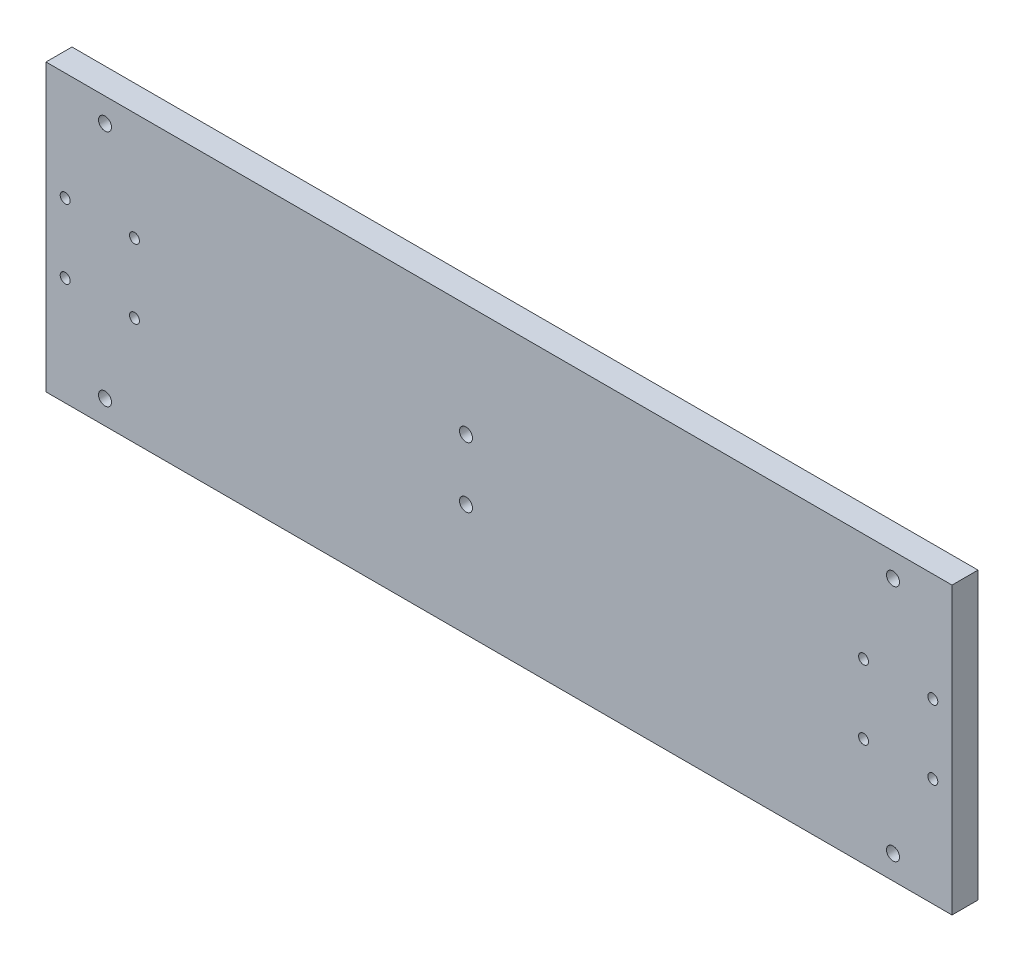
ISO-10303-21;
HEADER;
FILE_DESCRIPTION(('STEP AP214'),'2;1');
FILE_NAME('part.step','',(''),(''),'','','');
FILE_SCHEMA(('AUTOMOTIVE_DESIGN { 1 0 10303 214 1 1 1 1 }'));
ENDSEC;
DATA;
#1=APPLICATION_CONTEXT('core data for automotive mechanical design processes');
#2=APPLICATION_PROTOCOL_DEFINITION('international standard','automotive_design',2000,#1);
#3=PRODUCT_CONTEXT('',#1,'mechanical');
#4=PRODUCT('Part','Part','',(#3));
#5=PRODUCT_RELATED_PRODUCT_CATEGORY('part','',(#4));
#6=PRODUCT_DEFINITION_FORMATION('','',#4);
#7=PRODUCT_DEFINITION_CONTEXT('part definition',#1,'design');
#8=PRODUCT_DEFINITION('design','',#6,#7);
#9=PRODUCT_DEFINITION_SHAPE('','',#8);
#10=(LENGTH_UNIT() NAMED_UNIT(*) SI_UNIT(.MILLI.,.METRE.));
#11=(NAMED_UNIT(*) PLANE_ANGLE_UNIT() SI_UNIT($,.RADIAN.));
#12=(NAMED_UNIT(*) SI_UNIT($,.STERADIAN.) SOLID_ANGLE_UNIT());
#13=UNCERTAINTY_MEASURE_WITH_UNIT(LENGTH_MEASURE(1.E-05),#10,'distance_accuracy_value','');
#14=(GEOMETRIC_REPRESENTATION_CONTEXT(3) GLOBAL_UNCERTAINTY_ASSIGNED_CONTEXT((#13)) GLOBAL_UNIT_ASSIGNED_CONTEXT((#10,
#11,#12)) REPRESENTATION_CONTEXT('',''));
#15=CARTESIAN_POINT('',(0.,0.,0.));
#16=DIRECTION('',(0.,0.,1.));
#17=DIRECTION('',(1.,0.,0.));
#18=AXIS2_PLACEMENT_3D('',#15,#16,#17);
#19=CARTESIAN_POINT('',(-104.63,33.,6.));
#20=DIRECTION('',(1.,0.,0.));
#21=DIRECTION('',(0.,1.,0.));
#22=AXIS2_PLACEMENT_3D('',#19,#20,#21);
#23=PLANE('',#22);
#24=DIRECTION('',(0.,-1.,0.));
#25=VECTOR('',#24,1.);
#26=CARTESIAN_POINT('',(-104.63,33.,0.));
#27=LINE('',#26,#25);
#28=CARTESIAN_POINT('',(-104.63,33.,0.));
#29=VERTEX_POINT('',#28);
#30=CARTESIAN_POINT('',(-104.63,-33.,0.));
#31=VERTEX_POINT('',#30);
#32=EDGE_CURVE('E96',#29,#31,#27,.T.);
#33=ORIENTED_EDGE('',*,*,#32,.T.);
#34=DIRECTION('',(0.,0.,-1.));
#35=VECTOR('',#34,1.);
#36=CARTESIAN_POINT('',(-104.63,-33.,6.));
#37=LINE('',#36,#35);
#38=CARTESIAN_POINT('',(-104.63,-33.,6.));
#39=VERTEX_POINT('',#38);
#40=EDGE_CURVE('E11',#39,#31,#37,.T.);
#41=ORIENTED_EDGE('',*,*,#40,.F.);
#42=DIRECTION('',(0.,-1.,0.));
#43=VECTOR('',#42,1.);
#44=CARTESIAN_POINT('',(-104.63,33.,6.));
#45=LINE('',#44,#43);
#46=CARTESIAN_POINT('',(-104.63,33.,6.));
#47=VERTEX_POINT('',#46);
#48=EDGE_CURVE('E84',#47,#39,#45,.T.);
#49=ORIENTED_EDGE('',*,*,#48,.F.);
#50=DIRECTION('',(0.,0.,-1.));
#51=VECTOR('',#50,1.);
#52=CARTESIAN_POINT('',(-104.63,33.,6.));
#53=LINE('',#52,#51);
#54=EDGE_CURVE('E92',#47,#29,#53,.T.);
#55=ORIENTED_EDGE('',*,*,#54,.T.);
#56=EDGE_LOOP('',(#33,#41,#49,#55));
#57=FACE_BOUND('',#56,.T.);
#58=ADVANCED_FACE('F33',(#57),#23,.F.);
#59=CARTESIAN_POINT('',(-104.63,-33.,6.));
#60=DIRECTION('',(0.,1.,0.));
#61=DIRECTION('',(0.,0.,1.));
#62=AXIS2_PLACEMENT_3D('',#59,#60,#61);
#63=PLANE('',#62);
#64=DIRECTION('',(1.,0.,0.));
#65=VECTOR('',#64,1.);
#66=CARTESIAN_POINT('',(-104.63,-33.,0.));
#67=LINE('',#66,#65);
#68=CARTESIAN_POINT('',(104.63,-33.,0.));
#69=VERTEX_POINT('',#68);
#70=EDGE_CURVE('E88',#31,#69,#67,.T.);
#71=ORIENTED_EDGE('',*,*,#70,.T.);
#72=DIRECTION('',(0.,0.,-1.));
#73=VECTOR('',#72,1.);
#74=CARTESIAN_POINT('',(104.63,-33.,6.));
#75=LINE('',#74,#73);
#76=CARTESIAN_POINT('',(104.63,-33.,6.));
#77=VERTEX_POINT('',#76);
#78=EDGE_CURVE('E41',#77,#69,#75,.T.);
#79=ORIENTED_EDGE('',*,*,#78,.F.);
#80=DIRECTION('',(1.,0.,0.));
#81=VECTOR('',#80,1.);
#82=CARTESIAN_POINT('',(-104.63,-33.,6.));
#83=LINE('',#82,#81);
#84=EDGE_CURVE('E79',#39,#77,#83,.T.);
#85=ORIENTED_EDGE('',*,*,#84,.F.);
#86=ORIENTED_EDGE('',*,*,#40,.T.);
#87=EDGE_LOOP('',(#71,#79,#85,#86));
#88=FACE_BOUND('',#87,.T.);
#89=ADVANCED_FACE('F87',(#88),#63,.F.);
#90=CARTESIAN_POINT('',(104.63,33.,6.));
#91=DIRECTION('',(-1.,0.,0.));
#92=DIRECTION('',(0.,-1.,0.));
#93=AXIS2_PLACEMENT_3D('',#90,#91,#92);
#94=PLANE('',#93);
#95=DIRECTION('',(0.,1.,0.));
#96=VECTOR('',#95,1.);
#97=CARTESIAN_POINT('',(104.63,33.,0.));
#98=LINE('',#97,#96);
#99=CARTESIAN_POINT('',(104.63,33.,0.));
#100=VERTEX_POINT('',#99);
#101=EDGE_CURVE('E66',#69,#100,#98,.T.);
#102=ORIENTED_EDGE('',*,*,#101,.T.);
#103=DIRECTION('',(0.,0.,-1.));
#104=VECTOR('',#103,1.);
#105=CARTESIAN_POINT('',(104.63,33.,6.));
#106=LINE('',#105,#104);
#107=CARTESIAN_POINT('',(104.63,33.,6.));
#108=VERTEX_POINT('',#107);
#109=EDGE_CURVE('E89',#108,#100,#106,.T.);
#110=ORIENTED_EDGE('',*,*,#109,.F.);
#111=DIRECTION('',(0.,1.,0.));
#112=VECTOR('',#111,1.);
#113=CARTESIAN_POINT('',(104.63,33.,6.));
#114=LINE('',#113,#112);
#115=EDGE_CURVE('E82',#77,#108,#114,.T.);
#116=ORIENTED_EDGE('',*,*,#115,.F.);
#117=ORIENTED_EDGE('',*,*,#78,.T.);
#118=EDGE_LOOP('',(#102,#110,#116,#117));
#119=FACE_BOUND('',#118,.T.);
#120=ADVANCED_FACE('F90',(#119),#94,.F.);
#121=CARTESIAN_POINT('',(-104.63,33.,6.));
#122=DIRECTION('',(0.,-1.,0.));
#123=DIRECTION('',(0.,0.,-1.));
#124=AXIS2_PLACEMENT_3D('',#121,#122,#123);
#125=PLANE('',#124);
#126=DIRECTION('',(-1.,0.,0.));
#127=VECTOR('',#126,1.);
#128=CARTESIAN_POINT('',(-104.63,33.,0.));
#129=LINE('',#128,#127);
#130=EDGE_CURVE('E72',#100,#29,#129,.T.);
#131=ORIENTED_EDGE('',*,*,#130,.T.);
#132=ORIENTED_EDGE('',*,*,#54,.F.);
#133=DIRECTION('',(-1.,0.,0.));
#134=VECTOR('',#133,1.);
#135=CARTESIAN_POINT('',(-104.63,33.,6.));
#136=LINE('',#135,#134);
#137=EDGE_CURVE('E49',#108,#47,#136,.T.);
#138=ORIENTED_EDGE('',*,*,#137,.F.);
#139=ORIENTED_EDGE('',*,*,#109,.T.);
#140=EDGE_LOOP('',(#131,#132,#138,#139));
#141=FACE_BOUND('',#140,.T.);
#142=ADVANCED_FACE('F104',(#141),#125,.F.);
#143=CARTESIAN_POINT('',(0.,0.,6.));
#144=DIRECTION('',(0.,0.,1.));
#145=DIRECTION('',(1.,0.,0.));
#146=AXIS2_PLACEMENT_3D('',#143,#144,#145);
#147=PLANE('',#146);
#148=CARTESIAN_POINT('',(-91.,27.5,6.));
#149=DIRECTION('',(0.,0.,1.));
#150=DIRECTION('',(-1.,0.,0.));
#151=AXIS2_PLACEMENT_3D('',#148,#149,#150);
#152=CIRCLE('',#151,1.5);
#153=CARTESIAN_POINT('',(-92.5,27.5,6.));
#154=VERTEX_POINT('',#153);
#155=EDGE_CURVE('E188',#154,#154,#152,.T.);
#156=ORIENTED_EDGE('',*,*,#155,.F.);
#157=EDGE_LOOP('',(#156));
#158=FACE_BOUND('',#157,.T.);
#159=CARTESIAN_POINT('',(-91.,-27.5,6.));
#160=DIRECTION('',(0.,0.,1.));
#161=DIRECTION('',(-1.,0.,0.));
#162=AXIS2_PLACEMENT_3D('',#159,#160,#161);
#163=CIRCLE('',#162,1.5);
#164=CARTESIAN_POINT('',(-92.5,-27.5,6.));
#165=VERTEX_POINT('',#164);
#166=EDGE_CURVE('E182',#165,#165,#163,.T.);
#167=ORIENTED_EDGE('',*,*,#166,.F.);
#168=EDGE_LOOP('',(#167));
#169=FACE_BOUND('',#168,.T.);
#170=CARTESIAN_POINT('',(91.,-27.5,6.));
#171=DIRECTION('',(0.,0.,1.));
#172=DIRECTION('',(1.,0.,0.));
#173=AXIS2_PLACEMENT_3D('',#170,#171,#172);
#174=CIRCLE('',#173,1.5);
#175=CARTESIAN_POINT('',(92.5,-27.5,6.));
#176=VERTEX_POINT('',#175);
#177=EDGE_CURVE('E176',#176,#176,#174,.T.);
#178=ORIENTED_EDGE('',*,*,#177,.F.);
#179=EDGE_LOOP('',(#178));
#180=FACE_BOUND('',#179,.T.);
#181=CARTESIAN_POINT('',(91.,27.5,6.));
#182=DIRECTION('',(0.,0.,1.));
#183=DIRECTION('',(1.,0.,0.));
#184=AXIS2_PLACEMENT_3D('',#181,#182,#183);
#185=CIRCLE('',#184,1.5);
#186=CARTESIAN_POINT('',(92.5,27.5,6.));
#187=VERTEX_POINT('',#186);
#188=EDGE_CURVE('E170',#187,#187,#185,.T.);
#189=ORIENTED_EDGE('',*,*,#188,.F.);
#190=EDGE_LOOP('',(#189));
#191=FACE_BOUND('',#190,.T.);
#192=CARTESIAN_POINT('',(-7.62499999999999,-7.,6.));
#193=DIRECTION('',(0.,0.,1.));
#194=DIRECTION('',(1.,0.,0.));
#195=AXIS2_PLACEMENT_3D('',#192,#193,#194);
#196=CIRCLE('',#195,1.5);
#197=CARTESIAN_POINT('',(-6.12499999999999,-7.,6.));
#198=VERTEX_POINT('',#197);
#199=EDGE_CURVE('E164',#198,#198,#196,.T.);
#200=ORIENTED_EDGE('',*,*,#199,.F.);
#201=EDGE_LOOP('',(#200));
#202=FACE_BOUND('',#201,.T.);
#203=CARTESIAN_POINT('',(-7.62499999999999,7.,6.));
#204=DIRECTION('',(0.,0.,1.));
#205=DIRECTION('',(1.,0.,0.));
#206=AXIS2_PLACEMENT_3D('',#203,#204,#205);
#207=CIRCLE('',#206,1.5);
#208=CARTESIAN_POINT('',(-6.12499999999999,7.,6.));
#209=VERTEX_POINT('',#208);
#210=EDGE_CURVE('E158',#209,#209,#207,.T.);
#211=ORIENTED_EDGE('',*,*,#210,.F.);
#212=EDGE_LOOP('',(#211));
#213=FACE_BOUND('',#212,.T.);
#214=CARTESIAN_POINT('',(100.2,8.00000000000002,6.));
#215=DIRECTION('',(0.,0.,1.));
#216=DIRECTION('',(-1.,0.,0.));
#217=AXIS2_PLACEMENT_3D('',#214,#215,#216);
#218=CIRCLE('',#217,1.15);
#219=CARTESIAN_POINT('',(99.05,8.00000000000002,6.));
#220=VERTEX_POINT('',#219);
#221=EDGE_CURVE('E152',#220,#220,#218,.T.);
#222=ORIENTED_EDGE('',*,*,#221,.F.);
#223=EDGE_LOOP('',(#222));
#224=FACE_BOUND('',#223,.T.);
#225=CARTESIAN_POINT('',(84.2,8.00000000000003,6.));
#226=DIRECTION('',(0.,0.,1.));
#227=DIRECTION('',(-1.,0.,0.));
#228=AXIS2_PLACEMENT_3D('',#225,#226,#227);
#229=CIRCLE('',#228,1.15);
#230=CARTESIAN_POINT('',(83.05,8.00000000000003,6.));
#231=VERTEX_POINT('',#230);
#232=EDGE_CURVE('E146',#231,#231,#229,.T.);
#233=ORIENTED_EDGE('',*,*,#232,.F.);
#234=EDGE_LOOP('',(#233));
#235=FACE_BOUND('',#234,.T.);
#236=CARTESIAN_POINT('',(84.2,-7.99999999999997,6.));
#237=DIRECTION('',(0.,0.,1.));
#238=DIRECTION('',(-1.,0.,0.));
#239=AXIS2_PLACEMENT_3D('',#236,#237,#238);
#240=CIRCLE('',#239,1.15);
#241=CARTESIAN_POINT('',(83.05,-7.99999999999997,6.));
#242=VERTEX_POINT('',#241);
#243=EDGE_CURVE('E140',#242,#242,#240,.T.);
#244=ORIENTED_EDGE('',*,*,#243,.F.);
#245=EDGE_LOOP('',(#244));
#246=FACE_BOUND('',#245,.T.);
#247=CARTESIAN_POINT('',(100.2,-7.99999999999998,6.));
#248=DIRECTION('',(0.,0.,1.));
#249=DIRECTION('',(-1.,0.,0.));
#250=AXIS2_PLACEMENT_3D('',#247,#248,#249);
#251=CIRCLE('',#250,1.15);
#252=CARTESIAN_POINT('',(99.05,-7.99999999999998,6.));
#253=VERTEX_POINT('',#252);
#254=EDGE_CURVE('E134',#253,#253,#251,.T.);
#255=ORIENTED_EDGE('',*,*,#254,.F.);
#256=EDGE_LOOP('',(#255));
#257=FACE_BOUND('',#256,.T.);
#258=CARTESIAN_POINT('',(-100.2,-8.,6.));
#259=DIRECTION('',(0.,0.,1.));
#260=DIRECTION('',(1.,0.,0.));
#261=AXIS2_PLACEMENT_3D('',#258,#259,#260);
#262=CIRCLE('',#261,1.15);
#263=CARTESIAN_POINT('',(-99.05,-8.,6.));
#264=VERTEX_POINT('',#263);
#265=EDGE_CURVE('E128',#264,#264,#262,.T.);
#266=ORIENTED_EDGE('',*,*,#265,.F.);
#267=EDGE_LOOP('',(#266));
#268=FACE_BOUND('',#267,.T.);
#269=CARTESIAN_POINT('',(-84.2,-7.99999999999999,6.));
#270=DIRECTION('',(0.,0.,1.));
#271=DIRECTION('',(1.,0.,0.));
#272=AXIS2_PLACEMENT_3D('',#269,#270,#271);
#273=CIRCLE('',#272,1.15);
#274=CARTESIAN_POINT('',(-83.05,-7.99999999999999,6.));
#275=VERTEX_POINT('',#274);
#276=EDGE_CURVE('E122',#275,#275,#273,.T.);
#277=ORIENTED_EDGE('',*,*,#276,.F.);
#278=EDGE_LOOP('',(#277));
#279=FACE_BOUND('',#278,.T.);
#280=CARTESIAN_POINT('',(-84.2,8.00000000000001,6.));
#281=DIRECTION('',(0.,0.,1.));
#282=DIRECTION('',(1.,0.,0.));
#283=AXIS2_PLACEMENT_3D('',#280,#281,#282);
#284=CIRCLE('',#283,1.15);
#285=CARTESIAN_POINT('',(-83.05,8.00000000000001,6.));
#286=VERTEX_POINT('',#285);
#287=EDGE_CURVE('E116',#286,#286,#284,.T.);
#288=ORIENTED_EDGE('',*,*,#287,.F.);
#289=EDGE_LOOP('',(#288));
#290=FACE_BOUND('',#289,.T.);
#291=CARTESIAN_POINT('',(-100.2,8.,6.));
#292=DIRECTION('',(0.,0.,1.));
#293=DIRECTION('',(1.,0.,0.));
#294=AXIS2_PLACEMENT_3D('',#291,#292,#293);
#295=CIRCLE('',#294,1.15);
#296=CARTESIAN_POINT('',(-99.05,8.,6.));
#297=VERTEX_POINT('',#296);
#298=EDGE_CURVE('E110',#297,#297,#295,.T.);
#299=ORIENTED_EDGE('',*,*,#298,.F.);
#300=EDGE_LOOP('',(#299));
#301=FACE_BOUND('',#300,.T.);
#302=ORIENTED_EDGE('',*,*,#48,.T.);
#303=ORIENTED_EDGE('',*,*,#84,.T.);
#304=ORIENTED_EDGE('',*,*,#115,.T.);
#305=ORIENTED_EDGE('',*,*,#137,.T.);
#306=EDGE_LOOP('',(#302,#303,#304,#305));
#307=FACE_BOUND('',#306,.T.);
#308=ADVANCED_FACE('F80',(#158,#169,#180,#191,#202,#213,#224,#235,#246,#257,#268,#279,#290,#301,
#307),#147,.T.);
#309=CARTESIAN_POINT('',(0.,0.,0.));
#310=DIRECTION('',(0.,0.,1.));
#311=DIRECTION('',(1.,0.,0.));
#312=AXIS2_PLACEMENT_3D('',#309,#310,#311);
#313=PLANE('',#312);
#314=CARTESIAN_POINT('',(-91.,27.5,0.));
#315=DIRECTION('',(0.,0.,1.));
#316=DIRECTION('',(-1.,0.,0.));
#317=AXIS2_PLACEMENT_3D('',#314,#315,#316);
#318=CIRCLE('',#317,1.5);
#319=CARTESIAN_POINT('',(-92.5,27.5,0.));
#320=VERTEX_POINT('',#319);
#321=EDGE_CURVE('E185',#320,#320,#318,.T.);
#322=ORIENTED_EDGE('',*,*,#321,.T.);
#323=EDGE_LOOP('',(#322));
#324=FACE_BOUND('',#323,.T.);
#325=CARTESIAN_POINT('',(-91.,-27.5,0.));
#326=DIRECTION('',(0.,0.,1.));
#327=DIRECTION('',(-1.,0.,0.));
#328=AXIS2_PLACEMENT_3D('',#325,#326,#327);
#329=CIRCLE('',#328,1.5);
#330=CARTESIAN_POINT('',(-92.5,-27.5,0.));
#331=VERTEX_POINT('',#330);
#332=EDGE_CURVE('E179',#331,#331,#329,.T.);
#333=ORIENTED_EDGE('',*,*,#332,.T.);
#334=EDGE_LOOP('',(#333));
#335=FACE_BOUND('',#334,.T.);
#336=CARTESIAN_POINT('',(91.,-27.5,0.));
#337=DIRECTION('',(0.,0.,1.));
#338=DIRECTION('',(1.,0.,0.));
#339=AXIS2_PLACEMENT_3D('',#336,#337,#338);
#340=CIRCLE('',#339,1.5);
#341=CARTESIAN_POINT('',(92.5,-27.5,0.));
#342=VERTEX_POINT('',#341);
#343=EDGE_CURVE('E173',#342,#342,#340,.T.);
#344=ORIENTED_EDGE('',*,*,#343,.T.);
#345=EDGE_LOOP('',(#344));
#346=FACE_BOUND('',#345,.T.);
#347=CARTESIAN_POINT('',(91.,27.5,0.));
#348=DIRECTION('',(0.,0.,1.));
#349=DIRECTION('',(1.,0.,0.));
#350=AXIS2_PLACEMENT_3D('',#347,#348,#349);
#351=CIRCLE('',#350,1.5);
#352=CARTESIAN_POINT('',(92.5,27.5,0.));
#353=VERTEX_POINT('',#352);
#354=EDGE_CURVE('E167',#353,#353,#351,.T.);
#355=ORIENTED_EDGE('',*,*,#354,.T.);
#356=EDGE_LOOP('',(#355));
#357=FACE_BOUND('',#356,.T.);
#358=CARTESIAN_POINT('',(-7.62499999999999,-7.,0.));
#359=DIRECTION('',(0.,0.,1.));
#360=DIRECTION('',(1.,0.,0.));
#361=AXIS2_PLACEMENT_3D('',#358,#359,#360);
#362=CIRCLE('',#361,1.5);
#363=CARTESIAN_POINT('',(-6.12499999999999,-7.,0.));
#364=VERTEX_POINT('',#363);
#365=EDGE_CURVE('E161',#364,#364,#362,.T.);
#366=ORIENTED_EDGE('',*,*,#365,.T.);
#367=EDGE_LOOP('',(#366));
#368=FACE_BOUND('',#367,.T.);
#369=CARTESIAN_POINT('',(-7.62499999999999,7.,0.));
#370=DIRECTION('',(0.,0.,1.));
#371=DIRECTION('',(1.,0.,0.));
#372=AXIS2_PLACEMENT_3D('',#369,#370,#371);
#373=CIRCLE('',#372,1.5);
#374=CARTESIAN_POINT('',(-6.12499999999999,7.,0.));
#375=VERTEX_POINT('',#374);
#376=EDGE_CURVE('E155',#375,#375,#373,.T.);
#377=ORIENTED_EDGE('',*,*,#376,.T.);
#378=EDGE_LOOP('',(#377));
#379=FACE_BOUND('',#378,.T.);
#380=CARTESIAN_POINT('',(100.2,8.00000000000002,0.));
#381=DIRECTION('',(0.,0.,1.));
#382=DIRECTION('',(-1.,0.,0.));
#383=AXIS2_PLACEMENT_3D('',#380,#381,#382);
#384=CIRCLE('',#383,1.15);
#385=CARTESIAN_POINT('',(99.05,8.00000000000002,0.));
#386=VERTEX_POINT('',#385);
#387=EDGE_CURVE('E149',#386,#386,#384,.T.);
#388=ORIENTED_EDGE('',*,*,#387,.T.);
#389=EDGE_LOOP('',(#388));
#390=FACE_BOUND('',#389,.T.);
#391=CARTESIAN_POINT('',(84.2,8.00000000000003,0.));
#392=DIRECTION('',(0.,0.,1.));
#393=DIRECTION('',(-1.,0.,0.));
#394=AXIS2_PLACEMENT_3D('',#391,#392,#393);
#395=CIRCLE('',#394,1.15);
#396=CARTESIAN_POINT('',(83.05,8.00000000000003,0.));
#397=VERTEX_POINT('',#396);
#398=EDGE_CURVE('E143',#397,#397,#395,.T.);
#399=ORIENTED_EDGE('',*,*,#398,.T.);
#400=EDGE_LOOP('',(#399));
#401=FACE_BOUND('',#400,.T.);
#402=CARTESIAN_POINT('',(84.2,-7.99999999999997,0.));
#403=DIRECTION('',(0.,0.,1.));
#404=DIRECTION('',(-1.,0.,0.));
#405=AXIS2_PLACEMENT_3D('',#402,#403,#404);
#406=CIRCLE('',#405,1.15);
#407=CARTESIAN_POINT('',(83.05,-7.99999999999997,0.));
#408=VERTEX_POINT('',#407);
#409=EDGE_CURVE('E137',#408,#408,#406,.T.);
#410=ORIENTED_EDGE('',*,*,#409,.T.);
#411=EDGE_LOOP('',(#410));
#412=FACE_BOUND('',#411,.T.);
#413=CARTESIAN_POINT('',(100.2,-7.99999999999998,0.));
#414=DIRECTION('',(0.,0.,1.));
#415=DIRECTION('',(-1.,0.,0.));
#416=AXIS2_PLACEMENT_3D('',#413,#414,#415);
#417=CIRCLE('',#416,1.15);
#418=CARTESIAN_POINT('',(99.05,-7.99999999999998,0.));
#419=VERTEX_POINT('',#418);
#420=EDGE_CURVE('E131',#419,#419,#417,.T.);
#421=ORIENTED_EDGE('',*,*,#420,.T.);
#422=EDGE_LOOP('',(#421));
#423=FACE_BOUND('',#422,.T.);
#424=CARTESIAN_POINT('',(-100.2,-8.,0.));
#425=DIRECTION('',(0.,0.,1.));
#426=DIRECTION('',(1.,0.,0.));
#427=AXIS2_PLACEMENT_3D('',#424,#425,#426);
#428=CIRCLE('',#427,1.15);
#429=CARTESIAN_POINT('',(-99.05,-8.,0.));
#430=VERTEX_POINT('',#429);
#431=EDGE_CURVE('E125',#430,#430,#428,.T.);
#432=ORIENTED_EDGE('',*,*,#431,.T.);
#433=EDGE_LOOP('',(#432));
#434=FACE_BOUND('',#433,.T.);
#435=CARTESIAN_POINT('',(-84.2,-7.99999999999999,0.));
#436=DIRECTION('',(0.,0.,1.));
#437=DIRECTION('',(1.,0.,0.));
#438=AXIS2_PLACEMENT_3D('',#435,#436,#437);
#439=CIRCLE('',#438,1.15);
#440=CARTESIAN_POINT('',(-83.05,-7.99999999999999,0.));
#441=VERTEX_POINT('',#440);
#442=EDGE_CURVE('E119',#441,#441,#439,.T.);
#443=ORIENTED_EDGE('',*,*,#442,.T.);
#444=EDGE_LOOP('',(#443));
#445=FACE_BOUND('',#444,.T.);
#446=CARTESIAN_POINT('',(-84.2,8.00000000000001,0.));
#447=DIRECTION('',(0.,0.,1.));
#448=DIRECTION('',(1.,0.,0.));
#449=AXIS2_PLACEMENT_3D('',#446,#447,#448);
#450=CIRCLE('',#449,1.15);
#451=CARTESIAN_POINT('',(-83.05,8.00000000000001,0.));
#452=VERTEX_POINT('',#451);
#453=EDGE_CURVE('E113',#452,#452,#450,.T.);
#454=ORIENTED_EDGE('',*,*,#453,.T.);
#455=EDGE_LOOP('',(#454));
#456=FACE_BOUND('',#455,.T.);
#457=CARTESIAN_POINT('',(-100.2,8.,0.));
#458=DIRECTION('',(0.,0.,1.));
#459=DIRECTION('',(1.,0.,0.));
#460=AXIS2_PLACEMENT_3D('',#457,#458,#459);
#461=CIRCLE('',#460,1.15);
#462=CARTESIAN_POINT('',(-99.05,8.,0.));
#463=VERTEX_POINT('',#462);
#464=EDGE_CURVE('E99',#463,#463,#461,.T.);
#465=ORIENTED_EDGE('',*,*,#464,.T.);
#466=EDGE_LOOP('',(#465));
#467=FACE_BOUND('',#466,.T.);
#468=ORIENTED_EDGE('',*,*,#32,.F.);
#469=ORIENTED_EDGE('',*,*,#130,.F.);
#470=ORIENTED_EDGE('',*,*,#101,.F.);
#471=ORIENTED_EDGE('',*,*,#70,.F.);
#472=EDGE_LOOP('',(#468,#469,#470,#471));
#473=FACE_BOUND('',#472,.T.);
#474=ADVANCED_FACE('F107',(#324,#335,#346,#357,#368,#379,#390,#401,#412,#423,#434,#445,#456,
#467,#473),#313,.F.);
#475=CARTESIAN_POINT('',(-100.2,8.,0.));
#476=DIRECTION('',(0.,0.,1.));
#477=DIRECTION('',(1.,0.,0.));
#478=AXIS2_PLACEMENT_3D('',#475,#476,#477);
#479=CYLINDRICAL_SURFACE('',#478,1.15);
#480=ORIENTED_EDGE('',*,*,#464,.F.);
#481=EDGE_LOOP('',(#480));
#482=FACE_BOUND('',#481,.T.);
#483=ORIENTED_EDGE('',*,*,#298,.T.);
#484=EDGE_LOOP('',(#483));
#485=FACE_BOUND('',#484,.T.);
#486=ADVANCED_FACE('F232',(#482,#485),#479,.F.);
#487=CARTESIAN_POINT('',(-84.2,8.00000000000001,0.));
#488=DIRECTION('',(0.,0.,1.));
#489=DIRECTION('',(1.,0.,0.));
#490=AXIS2_PLACEMENT_3D('',#487,#488,#489);
#491=CYLINDRICAL_SURFACE('',#490,1.15);
#492=ORIENTED_EDGE('',*,*,#453,.F.);
#493=EDGE_LOOP('',(#492));
#494=FACE_BOUND('',#493,.T.);
#495=ORIENTED_EDGE('',*,*,#287,.T.);
#496=EDGE_LOOP('',(#495));
#497=FACE_BOUND('',#496,.T.);
#498=ADVANCED_FACE('F234',(#494,#497),#491,.F.);
#499=CARTESIAN_POINT('',(-84.2,-7.99999999999999,0.));
#500=DIRECTION('',(0.,0.,1.));
#501=DIRECTION('',(1.,0.,0.));
#502=AXIS2_PLACEMENT_3D('',#499,#500,#501);
#503=CYLINDRICAL_SURFACE('',#502,1.15);
#504=ORIENTED_EDGE('',*,*,#442,.F.);
#505=EDGE_LOOP('',(#504));
#506=FACE_BOUND('',#505,.T.);
#507=ORIENTED_EDGE('',*,*,#276,.T.);
#508=EDGE_LOOP('',(#507));
#509=FACE_BOUND('',#508,.T.);
#510=ADVANCED_FACE('F241',(#506,#509),#503,.F.);
#511=CARTESIAN_POINT('',(-100.2,-8.,0.));
#512=DIRECTION('',(0.,0.,1.));
#513=DIRECTION('',(1.,0.,0.));
#514=AXIS2_PLACEMENT_3D('',#511,#512,#513);
#515=CYLINDRICAL_SURFACE('',#514,1.15);
#516=ORIENTED_EDGE('',*,*,#431,.F.);
#517=EDGE_LOOP('',(#516));
#518=FACE_BOUND('',#517,.T.);
#519=ORIENTED_EDGE('',*,*,#265,.T.);
#520=EDGE_LOOP('',(#519));
#521=FACE_BOUND('',#520,.T.);
#522=ADVANCED_FACE('F287',(#518,#521),#515,.F.);
#523=CARTESIAN_POINT('',(100.2,-7.99999999999998,0.));
#524=DIRECTION('',(0.,0.,1.));
#525=DIRECTION('',(1.,0.,0.));
#526=AXIS2_PLACEMENT_3D('',#523,#524,#525);
#527=CYLINDRICAL_SURFACE('',#526,1.15);
#528=ORIENTED_EDGE('',*,*,#420,.F.);
#529=EDGE_LOOP('',(#528));
#530=FACE_BOUND('',#529,.T.);
#531=ORIENTED_EDGE('',*,*,#254,.T.);
#532=EDGE_LOOP('',(#531));
#533=FACE_BOUND('',#532,.T.);
#534=ADVANCED_FACE('F297',(#530,#533),#527,.F.);
#535=CARTESIAN_POINT('',(84.2,-7.99999999999997,0.));
#536=DIRECTION('',(0.,0.,1.));
#537=DIRECTION('',(1.,0.,0.));
#538=AXIS2_PLACEMENT_3D('',#535,#536,#537);
#539=CYLINDRICAL_SURFACE('',#538,1.15);
#540=ORIENTED_EDGE('',*,*,#409,.F.);
#541=EDGE_LOOP('',(#540));
#542=FACE_BOUND('',#541,.T.);
#543=ORIENTED_EDGE('',*,*,#243,.T.);
#544=EDGE_LOOP('',(#543));
#545=FACE_BOUND('',#544,.T.);
#546=ADVANCED_FACE('F307',(#542,#545),#539,.F.);
#547=CARTESIAN_POINT('',(84.2,8.00000000000003,0.));
#548=DIRECTION('',(0.,0.,1.));
#549=DIRECTION('',(1.,0.,0.));
#550=AXIS2_PLACEMENT_3D('',#547,#548,#549);
#551=CYLINDRICAL_SURFACE('',#550,1.15);
#552=ORIENTED_EDGE('',*,*,#398,.F.);
#553=EDGE_LOOP('',(#552));
#554=FACE_BOUND('',#553,.T.);
#555=ORIENTED_EDGE('',*,*,#232,.T.);
#556=EDGE_LOOP('',(#555));
#557=FACE_BOUND('',#556,.T.);
#558=ADVANCED_FACE('F317',(#554,#557),#551,.F.);
#559=CARTESIAN_POINT('',(100.2,8.00000000000002,0.));
#560=DIRECTION('',(0.,0.,1.));
#561=DIRECTION('',(1.,0.,0.));
#562=AXIS2_PLACEMENT_3D('',#559,#560,#561);
#563=CYLINDRICAL_SURFACE('',#562,1.15);
#564=ORIENTED_EDGE('',*,*,#387,.F.);
#565=EDGE_LOOP('',(#564));
#566=FACE_BOUND('',#565,.T.);
#567=ORIENTED_EDGE('',*,*,#221,.T.);
#568=EDGE_LOOP('',(#567));
#569=FACE_BOUND('',#568,.T.);
#570=ADVANCED_FACE('F327',(#566,#569),#563,.F.);
#571=CARTESIAN_POINT('',(-7.62499999999999,7.,0.));
#572=DIRECTION('',(0.,0.,1.));
#573=DIRECTION('',(1.,0.,0.));
#574=AXIS2_PLACEMENT_3D('',#571,#572,#573);
#575=CYLINDRICAL_SURFACE('',#574,1.5);
#576=ORIENTED_EDGE('',*,*,#376,.F.);
#577=EDGE_LOOP('',(#576));
#578=FACE_BOUND('',#577,.T.);
#579=ORIENTED_EDGE('',*,*,#210,.T.);
#580=EDGE_LOOP('',(#579));
#581=FACE_BOUND('',#580,.T.);
#582=ADVANCED_FACE('F337',(#578,#581),#575,.F.);
#583=CARTESIAN_POINT('',(-7.62499999999999,-7.,0.));
#584=DIRECTION('',(0.,0.,1.));
#585=DIRECTION('',(1.,0.,0.));
#586=AXIS2_PLACEMENT_3D('',#583,#584,#585);
#587=CYLINDRICAL_SURFACE('',#586,1.5);
#588=ORIENTED_EDGE('',*,*,#365,.F.);
#589=EDGE_LOOP('',(#588));
#590=FACE_BOUND('',#589,.T.);
#591=ORIENTED_EDGE('',*,*,#199,.T.);
#592=EDGE_LOOP('',(#591));
#593=FACE_BOUND('',#592,.T.);
#594=ADVANCED_FACE('F347',(#590,#593),#587,.F.);
#595=CARTESIAN_POINT('',(91.,27.5,0.));
#596=DIRECTION('',(0.,0.,1.));
#597=DIRECTION('',(1.,0.,0.));
#598=AXIS2_PLACEMENT_3D('',#595,#596,#597);
#599=CYLINDRICAL_SURFACE('',#598,1.5);
#600=ORIENTED_EDGE('',*,*,#354,.F.);
#601=EDGE_LOOP('',(#600));
#602=FACE_BOUND('',#601,.T.);
#603=ORIENTED_EDGE('',*,*,#188,.T.);
#604=EDGE_LOOP('',(#603));
#605=FACE_BOUND('',#604,.T.);
#606=ADVANCED_FACE('F357',(#602,#605),#599,.F.);
#607=CARTESIAN_POINT('',(91.,-27.5,0.));
#608=DIRECTION('',(0.,0.,1.));
#609=DIRECTION('',(1.,0.,0.));
#610=AXIS2_PLACEMENT_3D('',#607,#608,#609);
#611=CYLINDRICAL_SURFACE('',#610,1.5);
#612=ORIENTED_EDGE('',*,*,#343,.F.);
#613=EDGE_LOOP('',(#612));
#614=FACE_BOUND('',#613,.T.);
#615=ORIENTED_EDGE('',*,*,#177,.T.);
#616=EDGE_LOOP('',(#615));
#617=FACE_BOUND('',#616,.T.);
#618=ADVANCED_FACE('F367',(#614,#617),#611,.F.);
#619=CARTESIAN_POINT('',(-91.,-27.5,0.));
#620=DIRECTION('',(0.,0.,1.));
#621=DIRECTION('',(1.,0.,0.));
#622=AXIS2_PLACEMENT_3D('',#619,#620,#621);
#623=CYLINDRICAL_SURFACE('',#622,1.5);
#624=ORIENTED_EDGE('',*,*,#332,.F.);
#625=EDGE_LOOP('',(#624));
#626=FACE_BOUND('',#625,.T.);
#627=ORIENTED_EDGE('',*,*,#166,.T.);
#628=EDGE_LOOP('',(#627));
#629=FACE_BOUND('',#628,.T.);
#630=ADVANCED_FACE('F199',(#626,#629),#623,.F.);
#631=CARTESIAN_POINT('',(-91.,27.5,0.));
#632=DIRECTION('',(0.,0.,1.));
#633=DIRECTION('',(1.,0.,0.));
#634=AXIS2_PLACEMENT_3D('',#631,#632,#633);
#635=CYLINDRICAL_SURFACE('',#634,1.5);
#636=ORIENTED_EDGE('',*,*,#321,.F.);
#637=EDGE_LOOP('',(#636));
#638=FACE_BOUND('',#637,.T.);
#639=ORIENTED_EDGE('',*,*,#155,.T.);
#640=EDGE_LOOP('',(#639));
#641=FACE_BOUND('',#640,.T.);
#642=ADVANCED_FACE('F196',(#638,#641),#635,.F.);
#643=CLOSED_SHELL('',(#58,#89,#120,#142,#308,#474,#486,#498,#510,#522,#534,#546,#558,#570,#582,
#594,#606,#618,#630,#642));
#644=MANIFOLD_SOLID_BREP('B2',#643);
#645=ADVANCED_BREP_SHAPE_REPRESENTATION('',(#18,#644),#14);
#646=SHAPE_DEFINITION_REPRESENTATION(#9,#645);
ENDSEC;
END-ISO-10303-21;
